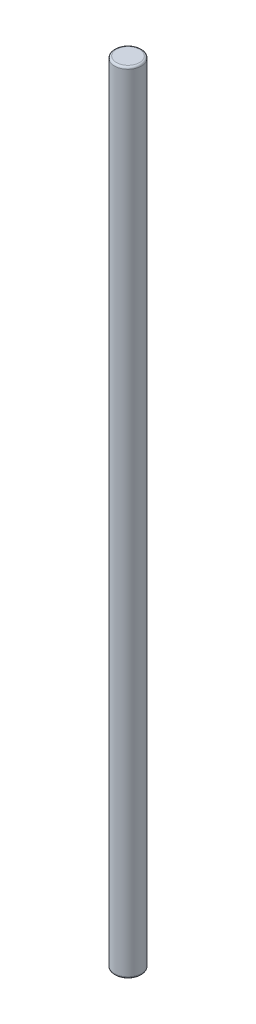
ISO-10303-21;
HEADER;
FILE_DESCRIPTION(('STEP AP214'),'2;1');
FILE_NAME('part.step','',(''),(''),'','','');
FILE_SCHEMA(('AUTOMOTIVE_DESIGN { 1 0 10303 214 1 1 1 1 }'));
ENDSEC;
DATA;
#1=APPLICATION_CONTEXT('core data for automotive mechanical design processes');
#2=APPLICATION_PROTOCOL_DEFINITION('international standard','automotive_design',2000,#1);
#3=PRODUCT_CONTEXT('',#1,'mechanical');
#4=PRODUCT('Part','Part','',(#3));
#5=PRODUCT_RELATED_PRODUCT_CATEGORY('part','',(#4));
#6=PRODUCT_DEFINITION_FORMATION('','',#4);
#7=PRODUCT_DEFINITION_CONTEXT('part definition',#1,'design');
#8=PRODUCT_DEFINITION('design','',#6,#7);
#9=PRODUCT_DEFINITION_SHAPE('','',#8);
#10=(LENGTH_UNIT() NAMED_UNIT(*) SI_UNIT(.MILLI.,.METRE.));
#11=(NAMED_UNIT(*) PLANE_ANGLE_UNIT() SI_UNIT($,.RADIAN.));
#12=(NAMED_UNIT(*) SI_UNIT($,.STERADIAN.) SOLID_ANGLE_UNIT());
#13=UNCERTAINTY_MEASURE_WITH_UNIT(LENGTH_MEASURE(1.E-05),#10,'distance_accuracy_value','');
#14=(GEOMETRIC_REPRESENTATION_CONTEXT(3) GLOBAL_UNCERTAINTY_ASSIGNED_CONTEXT((#13)) GLOBAL_UNIT_ASSIGNED_CONTEXT((#10,
#11,#12)) REPRESENTATION_CONTEXT('',''));
#15=CARTESIAN_POINT('',(0.,0.,0.));
#16=DIRECTION('',(0.,0.,1.));
#17=DIRECTION('',(1.,0.,0.));
#18=AXIS2_PLACEMENT_3D('',#15,#16,#17);
#19=CARTESIAN_POINT('',(0.,6.58260975515723,0.));
#20=DIRECTION('',(0.,-1.,0.));
#21=DIRECTION('',(0.,0.,-1.));
#22=AXIS2_PLACEMENT_3D('',#19,#20,#21);
#23=CYLINDRICAL_SURFACE('',#22,0.17145);
#24=CARTESIAN_POINT('',(0.,9.9822,0.));
#25=DIRECTION('',(0.,1.,0.));
#26=DIRECTION('',(0.,0.,1.));
#27=AXIS2_PLACEMENT_3D('',#24,#25,#26);
#28=CIRCLE('',#27,0.17145);
#29=CARTESIAN_POINT('',(0.,9.9822,0.17145));
#30=VERTEX_POINT('',#29);
#31=EDGE_CURVE('E11',#30,#30,#28,.F.);
#32=ORIENTED_EDGE('',*,*,#31,.T.);
#33=EDGE_LOOP('',(#32));
#34=FACE_BOUND('',#33,.T.);
#35=CARTESIAN_POINT('',(0.,0.0254000000000001,0.));
#36=DIRECTION('',(0.,1.,0.));
#37=DIRECTION('',(0.,0.,1.));
#38=AXIS2_PLACEMENT_3D('',#35,#36,#37);
#39=CIRCLE('',#38,0.17145);
#40=CARTESIAN_POINT('',(0.,0.0254000000000001,0.17145));
#41=VERTEX_POINT('',#40);
#42=EDGE_CURVE('E64',#41,#41,#39,.T.);
#43=ORIENTED_EDGE('',*,*,#42,.T.);
#44=EDGE_LOOP('',(#43));
#45=FACE_BOUND('',#44,.T.);
#46=ADVANCED_FACE('F44',(#34,#45),#23,.T.);
#47=CARTESIAN_POINT('',(0.,0.,0.));
#48=DIRECTION('',(0.,1.,0.));
#49=DIRECTION('',(0.,0.,1.));
#50=AXIS2_PLACEMENT_3D('',#47,#48,#49);
#51=PLANE('',#50);
#52=CARTESIAN_POINT('',(0.,0.,0.));
#53=DIRECTION('',(0.,1.,0.));
#54=DIRECTION('',(0.,0.,1.));
#55=AXIS2_PLACEMENT_3D('',#52,#53,#54);
#56=CIRCLE('',#55,0.14605);
#57=CARTESIAN_POINT('',(0.,0.,0.14605));
#58=VERTEX_POINT('',#57);
#59=EDGE_CURVE('E58',#58,#58,#56,.F.);
#60=ORIENTED_EDGE('',*,*,#59,.T.);
#61=EDGE_LOOP('',(#60));
#62=FACE_BOUND('',#61,.T.);
#63=ADVANCED_FACE('F76',(#62),#51,.F.);
#64=CARTESIAN_POINT('',(0.,0.0254000000000001,0.));
#65=DIRECTION('',(0.,1.,0.));
#66=DIRECTION('',(0.,0.,1.));
#67=AXIS2_PLACEMENT_3D('',#64,#65,#66);
#68=TOROIDAL_SURFACE('',#67,0.14605,0.0254);
#69=ORIENTED_EDGE('',*,*,#59,.F.);
#70=EDGE_LOOP('',(#69));
#71=FACE_BOUND('',#70,.T.);
#72=ORIENTED_EDGE('',*,*,#42,.F.);
#73=EDGE_LOOP('',(#72));
#74=FACE_BOUND('',#73,.T.);
#75=ADVANCED_FACE('F73',(#71,#74),#68,.T.);
#76=CARTESIAN_POINT('',(0.,10.0076,0.));
#77=DIRECTION('',(0.,1.,0.));
#78=DIRECTION('',(0.,0.,1.));
#79=AXIS2_PLACEMENT_3D('',#76,#77,#78);
#80=PLANE('',#79);
#81=CARTESIAN_POINT('',(0.,10.0076,0.));
#82=DIRECTION('',(0.,1.,0.));
#83=DIRECTION('',(0.,0.,1.));
#84=AXIS2_PLACEMENT_3D('',#81,#82,#83);
#85=CIRCLE('',#84,0.14605);
#86=CARTESIAN_POINT('',(0.,10.0076,0.14605));
#87=VERTEX_POINT('',#86);
#88=EDGE_CURVE('E52',#87,#87,#85,.T.);
#89=ORIENTED_EDGE('',*,*,#88,.T.);
#90=EDGE_LOOP('',(#89));
#91=FACE_BOUND('',#90,.T.);
#92=ADVANCED_FACE('F75',(#91),#80,.T.);
#93=CARTESIAN_POINT('',(0.,9.9822,0.));
#94=DIRECTION('',(0.,1.,0.));
#95=DIRECTION('',(0.,0.,1.));
#96=AXIS2_PLACEMENT_3D('',#93,#94,#95);
#97=TOROIDAL_SURFACE('',#96,0.14605,0.0254);
#98=ORIENTED_EDGE('',*,*,#31,.F.);
#99=EDGE_LOOP('',(#98));
#100=FACE_BOUND('',#99,.T.);
#101=ORIENTED_EDGE('',*,*,#88,.F.);
#102=EDGE_LOOP('',(#101));
#103=FACE_BOUND('',#102,.T.);
#104=ADVANCED_FACE('F46',(#100,#103),#97,.T.);
#105=CLOSED_SHELL('',(#46,#63,#75,#92,#104));
#106=MANIFOLD_SOLID_BREP('B2',#105);
#107=ADVANCED_BREP_SHAPE_REPRESENTATION('',(#18,#106),#14);
#108=SHAPE_DEFINITION_REPRESENTATION(#9,#107);
ENDSEC;
END-ISO-10303-21;
